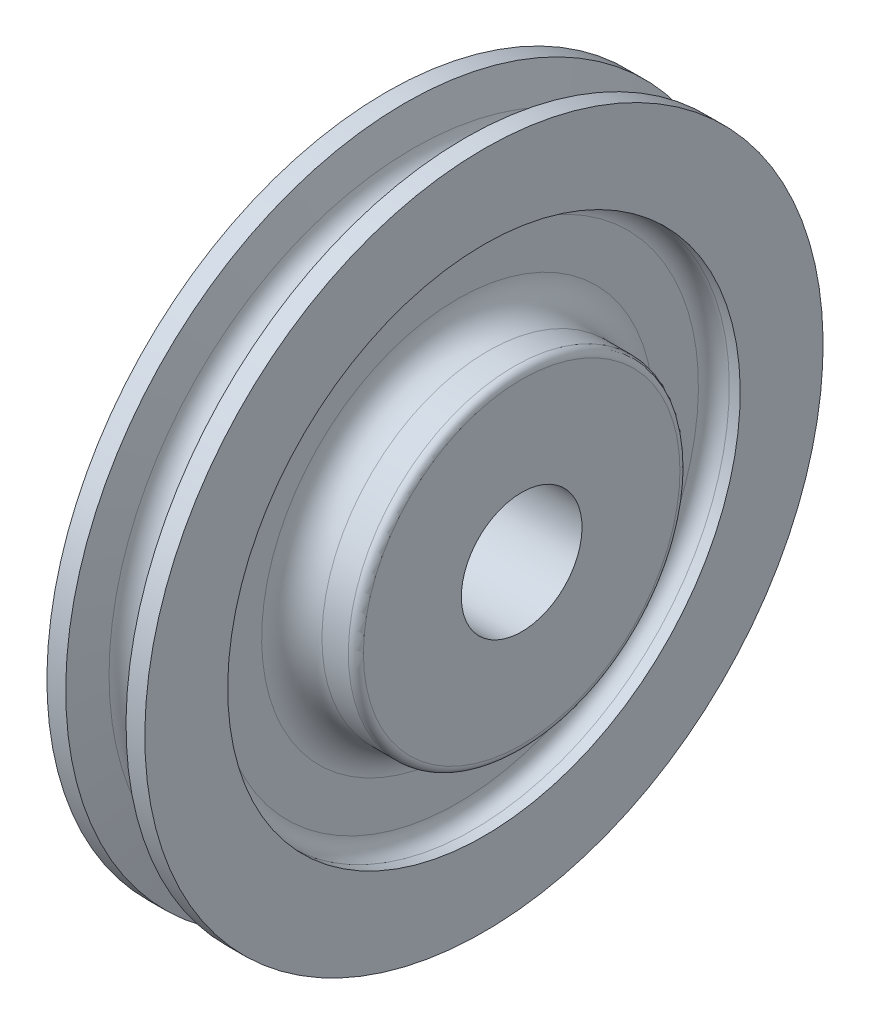
ISO-10303-21;
HEADER;
FILE_DESCRIPTION(('STEP AP214'),'2;1');
FILE_NAME('part.step','',(''),(''),'','','');
FILE_SCHEMA(('AUTOMOTIVE_DESIGN { 1 0 10303 214 1 1 1 1 }'));
ENDSEC;
DATA;
#1=APPLICATION_CONTEXT('core data for automotive mechanical design processes');
#2=APPLICATION_PROTOCOL_DEFINITION('international standard','automotive_design',2000,#1);
#3=PRODUCT_CONTEXT('',#1,'mechanical');
#4=PRODUCT('Part','Part','',(#3));
#5=PRODUCT_RELATED_PRODUCT_CATEGORY('part','',(#4));
#6=PRODUCT_DEFINITION_FORMATION('','',#4);
#7=PRODUCT_DEFINITION_CONTEXT('part definition',#1,'design');
#8=PRODUCT_DEFINITION('design','',#6,#7);
#9=PRODUCT_DEFINITION_SHAPE('','',#8);
#10=(LENGTH_UNIT() NAMED_UNIT(*) SI_UNIT(.MILLI.,.METRE.));
#11=(NAMED_UNIT(*) PLANE_ANGLE_UNIT() SI_UNIT($,.RADIAN.));
#12=(NAMED_UNIT(*) SI_UNIT($,.STERADIAN.) SOLID_ANGLE_UNIT());
#13=UNCERTAINTY_MEASURE_WITH_UNIT(LENGTH_MEASURE(1.E-05),#10,'distance_accuracy_value','');
#14=(GEOMETRIC_REPRESENTATION_CONTEXT(3) GLOBAL_UNCERTAINTY_ASSIGNED_CONTEXT((#13)) GLOBAL_UNIT_ASSIGNED_CONTEXT((#10,
#11,#12)) REPRESENTATION_CONTEXT('',''));
#15=CARTESIAN_POINT('',(0.,0.,0.));
#16=DIRECTION('',(0.,0.,1.));
#17=DIRECTION('',(1.,0.,0.));
#18=AXIS2_PLACEMENT_3D('',#15,#16,#17);
#19=CARTESIAN_POINT('',(11.1124999999993,0.,0.));
#20=DIRECTION('',(1.,0.,0.));
#21=DIRECTION('',(0.,1.,0.));
#22=AXIS2_PLACEMENT_3D('',#19,#20,#21);
#23=TOROIDAL_SURFACE('',#22,41.2750000000005,6.34999999999973);
#24=CARTESIAN_POINT('',(4.7624999999998,0.,0.));
#25=DIRECTION('',(1.,0.,0.));
#26=DIRECTION('',(0.,1.,0.));
#27=AXIS2_PLACEMENT_3D('',#24,#25,#26);
#28=CIRCLE('',#27,41.2749999999999);
#29=CARTESIAN_POINT('',(4.7625,41.2749999999999,0.));
#30=VERTEX_POINT('',#29);
#31=EDGE_CURVE('E10',#30,#30,#28,.T.);
#32=ORIENTED_EDGE('',*,*,#31,.T.);
#33=EDGE_LOOP('',(#32));
#34=FACE_BOUND('',#33,.T.);
#35=CARTESIAN_POINT('',(11.1124999999995,0.,0.));
#36=DIRECTION('',(1.,0.,0.));
#37=DIRECTION('',(0.,1.,0.));
#38=AXIS2_PLACEMENT_3D('',#35,#36,#37);
#39=CIRCLE('',#38,34.9250000000005);
#40=CARTESIAN_POINT('',(11.1124999999996,34.9250000000005,0.));
#41=VERTEX_POINT('',#40);
#42=EDGE_CURVE('E417',#41,#41,#39,.T.);
#43=ORIENTED_EDGE('',*,*,#42,.F.);
#44=EDGE_LOOP('',(#43));
#45=FACE_BOUND('',#44,.T.);
#46=ADVANCED_FACE('F353',(#34,#45),#23,.F.);
#47=CARTESIAN_POINT('',(4.76250000000002,50.7237999999999,0.));
#48=DIRECTION('',(1.,0.,0.));
#49=DIRECTION('',(0.,1.,0.));
#50=AXIS2_PLACEMENT_3D('',#47,#48,#49);
#51=PLANE('',#50);
#52=CARTESIAN_POINT('',(4.76249999999975,0.,0.));
#53=DIRECTION('',(1.,0.,0.));
#54=DIRECTION('',(0.,1.,0.));
#55=AXIS2_PLACEMENT_3D('',#52,#53,#54);
#56=CIRCLE('',#55,50.7237999999999);
#57=CARTESIAN_POINT('',(4.7625,50.7237999999999,0.));
#58=VERTEX_POINT('',#57);
#59=EDGE_CURVE('E359',#58,#58,#56,.T.);
#60=ORIENTED_EDGE('',*,*,#59,.T.);
#61=EDGE_LOOP('',(#60));
#62=FACE_BOUND('',#61,.T.);
#63=ORIENTED_EDGE('',*,*,#31,.F.);
#64=EDGE_LOOP('',(#63));
#65=FACE_BOUND('',#64,.T.);
#66=ADVANCED_FACE('F448',(#62,#65),#51,.T.);
#67=CARTESIAN_POINT('',(8.01369999999975,0.,0.));
#68=DIRECTION('',(1.,0.,0.));
#69=DIRECTION('',(0.,1.,0.));
#70=AXIS2_PLACEMENT_3D('',#67,#68,#69);
#71=TOROIDAL_SURFACE('',#70,50.7238,3.25120000000001);
#72=CARTESIAN_POINT('',(8.01369999999974,0.,0.));
#73=DIRECTION('',(1.,0.,0.));
#74=DIRECTION('',(0.,1.,0.));
#75=AXIS2_PLACEMENT_3D('',#72,#73,#74);
#76=CIRCLE('',#75,53.975);
#77=CARTESIAN_POINT('',(8.0137,53.9749999999999,0.));
#78=VERTEX_POINT('',#77);
#79=EDGE_CURVE('E363',#78,#78,#76,.T.);
#80=ORIENTED_EDGE('',*,*,#79,.T.);
#81=EDGE_LOOP('',(#80));
#82=FACE_BOUND('',#81,.T.);
#83=ORIENTED_EDGE('',*,*,#59,.F.);
#84=EDGE_LOOP('',(#83));
#85=FACE_BOUND('',#84,.T.);
#86=ADVANCED_FACE('F452',(#82,#85),#71,.F.);
#87=CARTESIAN_POINT('',(18.25625,0.,0.));
#88=DIRECTION('',(1.,0.,0.));
#89=DIRECTION('',(0.,1.,0.));
#90=AXIS2_PLACEMENT_3D('',#87,#88,#89);
#91=CYLINDRICAL_SURFACE('',#90,53.9750000000002);
#92=CARTESIAN_POINT('',(10.3123999999997,0.,0.));
#93=DIRECTION('',(1.,0.,0.));
#94=DIRECTION('',(0.,1.,0.));
#95=AXIS2_PLACEMENT_3D('',#92,#93,#94);
#96=CIRCLE('',#95,53.9750000000004);
#97=CARTESIAN_POINT('',(10.3124,53.9750000000003,0.));
#98=VERTEX_POINT('',#97);
#99=EDGE_CURVE('E367',#98,#98,#96,.T.);
#100=ORIENTED_EDGE('',*,*,#99,.T.);
#101=EDGE_LOOP('',(#100));
#102=FACE_BOUND('',#101,.T.);
#103=ORIENTED_EDGE('',*,*,#79,.F.);
#104=EDGE_LOOP('',(#103));
#105=FACE_BOUND('',#104,.T.);
#106=ADVANCED_FACE('F460',(#102,#105),#91,.F.);
#107=CARTESIAN_POINT('',(10.3124,71.4311499999999,0.));
#108=DIRECTION('',(1.,0.,0.));
#109=DIRECTION('',(0.,1.,0.));
#110=AXIS2_PLACEMENT_3D('',#107,#108,#109);
#111=PLANE('',#110);
#112=CARTESIAN_POINT('',(10.3123999999996,0.,0.));
#113=DIRECTION('',(1.,0.,0.));
#114=DIRECTION('',(0.,1.,0.));
#115=AXIS2_PLACEMENT_3D('',#112,#113,#114);
#116=CIRCLE('',#115,71.4311499999999);
#117=CARTESIAN_POINT('',(10.3124,71.4311499999999,0.));
#118=VERTEX_POINT('',#117);
#119=EDGE_CURVE('E372',#118,#118,#116,.T.);
#120=ORIENTED_EDGE('',*,*,#119,.T.);
#121=EDGE_LOOP('',(#120));
#122=FACE_BOUND('',#121,.T.);
#123=ORIENTED_EDGE('',*,*,#99,.F.);
#124=EDGE_LOOP('',(#123));
#125=FACE_BOUND('',#124,.T.);
#126=ADVANCED_FACE('F467',(#122,#125),#111,.T.);
#127=CARTESIAN_POINT('',(18.25625,0.,0.));
#128=DIRECTION('',(1.,0.,0.));
#129=DIRECTION('',(0.,1.,0.));
#130=AXIS2_PLACEMENT_3D('',#127,#128,#129);
#131=CYLINDRICAL_SURFACE('',#130,71.4311499999999);
#132=CARTESIAN_POINT('',(6.34999999999965,0.,0.));
#133=DIRECTION('',(1.,0.,0.));
#134=DIRECTION('',(0.,1.,0.));
#135=AXIS2_PLACEMENT_3D('',#132,#133,#134);
#136=CIRCLE('',#135,71.4311499999999);
#137=CARTESIAN_POINT('',(6.35,71.4311499999999,0.));
#138=VERTEX_POINT('',#137);
#139=EDGE_CURVE('E375',#138,#138,#136,.T.);
#140=ORIENTED_EDGE('',*,*,#139,.T.);
#141=EDGE_LOOP('',(#140));
#142=FACE_BOUND('',#141,.T.);
#143=ORIENTED_EDGE('',*,*,#119,.F.);
#144=EDGE_LOOP('',(#143));
#145=FACE_BOUND('',#144,.T.);
#146=ADVANCED_FACE('F471',(#142,#145),#131,.T.);
#147=CARTESIAN_POINT('',(6.34999999999965,0.,0.));
#148=DIRECTION('',(1.,0.,0.));
#149=DIRECTION('',(0.,1.,0.));
#150=AXIS2_PLACEMENT_3D('',#147,#148,#149);
#151=CONICAL_SURFACE('',#150,71.4311499999999,1.34420065973755);
#152=CARTESIAN_POINT('',(4.64075555889562,0.,0.));
#153=DIRECTION('',(1.,0.,0.));
#154=DIRECTION('',(0.,1.,0.));
#155=AXIS2_PLACEMENT_3D('',#152,#153,#154);
#156=CIRCLE('',#155,64.0175494905948);
#157=CARTESIAN_POINT('',(4.64075555889594,64.0175494905947,0.));
#158=VERTEX_POINT('',#157);
#159=EDGE_CURVE('E378',#158,#158,#156,.T.);
#160=ORIENTED_EDGE('',*,*,#159,.T.);
#161=EDGE_LOOP('',(#160));
#162=FACE_BOUND('',#161,.T.);
#163=ORIENTED_EDGE('',*,*,#139,.F.);
#164=EDGE_LOOP('',(#163));
#165=FACE_BOUND('',#164,.T.);
#166=ADVANCED_FACE('F475',(#162,#165),#151,.T.);
#167=CARTESIAN_POINT('',(-3.22658566531686E-13,0.,0.));
#168=DIRECTION('',(1.,0.,0.));
#169=DIRECTION('',(0.,1.,0.));
#170=AXIS2_PLACEMENT_3D('',#167,#168,#169);
#171=TOROIDAL_SURFACE('',#170,65.0874999999999,4.7625);
#172=CARTESIAN_POINT('',(-4.64075555889625,0.,0.));
#173=DIRECTION('',(1.,0.,0.));
#174=DIRECTION('',(0.,1.,0.));
#175=AXIS2_PLACEMENT_3D('',#172,#173,#174);
#176=CIRCLE('',#175,64.0175494905947);
#177=CARTESIAN_POINT('',(-4.64075555889593,64.0175494905947,0.));
#178=VERTEX_POINT('',#177);
#179=EDGE_CURVE('E381',#178,#178,#176,.T.);
#180=ORIENTED_EDGE('',*,*,#179,.T.);
#181=EDGE_LOOP('',(#180));
#182=FACE_BOUND('',#181,.T.);
#183=ORIENTED_EDGE('',*,*,#159,.F.);
#184=EDGE_LOOP('',(#183));
#185=FACE_BOUND('',#184,.T.);
#186=ADVANCED_FACE('F479',(#182,#185),#171,.F.);
#187=CARTESIAN_POINT('',(-4.64075555889625,0.,0.));
#188=DIRECTION('',(-1.,0.,0.));
#189=DIRECTION('',(0.,-1.,0.));
#190=AXIS2_PLACEMENT_3D('',#187,#188,#189);
#191=CONICAL_SURFACE('',#190,64.0175494905947,1.34420065973754);
#192=CARTESIAN_POINT('',(-6.35000000000035,0.,0.));
#193=DIRECTION('',(1.,0.,0.));
#194=DIRECTION('',(0.,1.,0.));
#195=AXIS2_PLACEMENT_3D('',#192,#193,#194);
#196=CIRCLE('',#195,71.4311499999999);
#197=CARTESIAN_POINT('',(-6.35,71.4311499999999,0.));
#198=VERTEX_POINT('',#197);
#199=EDGE_CURVE('E384',#198,#198,#196,.T.);
#200=ORIENTED_EDGE('',*,*,#199,.T.);
#201=EDGE_LOOP('',(#200));
#202=FACE_BOUND('',#201,.T.);
#203=ORIENTED_EDGE('',*,*,#179,.F.);
#204=EDGE_LOOP('',(#203));
#205=FACE_BOUND('',#204,.T.);
#206=ADVANCED_FACE('F483',(#202,#205),#191,.T.);
#207=CARTESIAN_POINT('',(18.25625,0.,0.));
#208=DIRECTION('',(1.,0.,0.));
#209=DIRECTION('',(0.,1.,0.));
#210=AXIS2_PLACEMENT_3D('',#207,#208,#209);
#211=CYLINDRICAL_SURFACE('',#210,71.4311499999998);
#212=CARTESIAN_POINT('',(-10.3124000000003,0.,0.));
#213=DIRECTION('',(1.,0.,0.));
#214=DIRECTION('',(0.,1.,0.));
#215=AXIS2_PLACEMENT_3D('',#212,#213,#214);
#216=CIRCLE('',#215,71.4311499999998);
#217=CARTESIAN_POINT('',(-10.3124,71.4311499999999,0.));
#218=VERTEX_POINT('',#217);
#219=EDGE_CURVE('E387',#218,#218,#216,.T.);
#220=ORIENTED_EDGE('',*,*,#219,.T.);
#221=EDGE_LOOP('',(#220));
#222=FACE_BOUND('',#221,.T.);
#223=ORIENTED_EDGE('',*,*,#199,.F.);
#224=EDGE_LOOP('',(#223));
#225=FACE_BOUND('',#224,.T.);
#226=ADVANCED_FACE('F487',(#222,#225),#211,.T.);
#227=CARTESIAN_POINT('',(-10.3123999999999,71.4311499999999,0.));
#228=DIRECTION('',(-1.,0.,0.));
#229=DIRECTION('',(0.,-1.,0.));
#230=AXIS2_PLACEMENT_3D('',#227,#228,#229);
#231=PLANE('',#230);
#232=CARTESIAN_POINT('',(-10.3124000000003,0.,0.));
#233=DIRECTION('',(1.,0.,0.));
#234=DIRECTION('',(0.,1.,0.));
#235=AXIS2_PLACEMENT_3D('',#232,#233,#234);
#236=CIRCLE('',#235,53.9750000000003);
#237=CARTESIAN_POINT('',(-10.3124,53.9750000000003,0.));
#238=VERTEX_POINT('',#237);
#239=EDGE_CURVE('E390',#238,#238,#236,.T.);
#240=ORIENTED_EDGE('',*,*,#239,.T.);
#241=EDGE_LOOP('',(#240));
#242=FACE_BOUND('',#241,.T.);
#243=ORIENTED_EDGE('',*,*,#219,.F.);
#244=EDGE_LOOP('',(#243));
#245=FACE_BOUND('',#244,.T.);
#246=ADVANCED_FACE('F491',(#242,#245),#231,.T.);
#247=CARTESIAN_POINT('',(18.25625,0.,0.));
#248=DIRECTION('',(1.,0.,0.));
#249=DIRECTION('',(0.,1.,0.));
#250=AXIS2_PLACEMENT_3D('',#247,#248,#249);
#251=CYLINDRICAL_SURFACE('',#250,53.9750000000001);
#252=CARTESIAN_POINT('',(-8.01370000000027,0.,0.));
#253=DIRECTION('',(1.,0.,0.));
#254=DIRECTION('',(0.,1.,0.));
#255=AXIS2_PLACEMENT_3D('',#252,#253,#254);
#256=CIRCLE('',#255,53.9749999999999);
#257=CARTESIAN_POINT('',(-8.01370000000001,53.9749999999999,0.));
#258=VERTEX_POINT('',#257);
#259=EDGE_CURVE('E393',#258,#258,#256,.T.);
#260=ORIENTED_EDGE('',*,*,#259,.T.);
#261=EDGE_LOOP('',(#260));
#262=FACE_BOUND('',#261,.T.);
#263=ORIENTED_EDGE('',*,*,#239,.F.);
#264=EDGE_LOOP('',(#263));
#265=FACE_BOUND('',#264,.T.);
#266=ADVANCED_FACE('F495',(#262,#265),#251,.F.);
#267=CARTESIAN_POINT('',(-8.01370000000026,0.,0.));
#268=DIRECTION('',(1.,0.,0.));
#269=DIRECTION('',(0.,1.,0.));
#270=AXIS2_PLACEMENT_3D('',#267,#268,#269);
#271=TOROIDAL_SURFACE('',#270,50.7237999999999,3.25120000000001);
#272=CARTESIAN_POINT('',(-4.76250000000025,0.,0.));
#273=DIRECTION('',(1.,0.,0.));
#274=DIRECTION('',(0.,1.,0.));
#275=AXIS2_PLACEMENT_3D('',#272,#273,#274);
#276=CIRCLE('',#275,50.7237999999999);
#277=CARTESIAN_POINT('',(-4.76249999999999,50.7237999999999,0.));
#278=VERTEX_POINT('',#277);
#279=EDGE_CURVE('E396',#278,#278,#276,.T.);
#280=ORIENTED_EDGE('',*,*,#279,.T.);
#281=EDGE_LOOP('',(#280));
#282=FACE_BOUND('',#281,.T.);
#283=ORIENTED_EDGE('',*,*,#259,.F.);
#284=EDGE_LOOP('',(#283));
#285=FACE_BOUND('',#284,.T.);
#286=ADVANCED_FACE('F499',(#282,#285),#271,.F.);
#287=CARTESIAN_POINT('',(-4.76249999999998,50.7237999999999,0.));
#288=DIRECTION('',(-1.,0.,0.));
#289=DIRECTION('',(0.,-1.,0.));
#290=AXIS2_PLACEMENT_3D('',#287,#288,#289);
#291=PLANE('',#290);
#292=CARTESIAN_POINT('',(-4.76250000000021,0.,0.));
#293=DIRECTION('',(1.,0.,0.));
#294=DIRECTION('',(0.,1.,0.));
#295=AXIS2_PLACEMENT_3D('',#292,#293,#294);
#296=CIRCLE('',#295,41.2749999999999);
#297=CARTESIAN_POINT('',(-4.7625,41.2749999999999,0.));
#298=VERTEX_POINT('',#297);
#299=EDGE_CURVE('E399',#298,#298,#296,.T.);
#300=ORIENTED_EDGE('',*,*,#299,.T.);
#301=EDGE_LOOP('',(#300));
#302=FACE_BOUND('',#301,.T.);
#303=ORIENTED_EDGE('',*,*,#279,.F.);
#304=EDGE_LOOP('',(#303));
#305=FACE_BOUND('',#304,.T.);
#306=ADVANCED_FACE('F503',(#302,#305),#291,.T.);
#307=CARTESIAN_POINT('',(-11.1125000000008,0.,0.));
#308=DIRECTION('',(1.,0.,0.));
#309=DIRECTION('',(0.,1.,0.));
#310=AXIS2_PLACEMENT_3D('',#307,#308,#309);
#311=TOROIDAL_SURFACE('',#310,41.275,6.35000000000027);
#312=CARTESIAN_POINT('',(-11.1125000000005,0.,0.));
#313=DIRECTION('',(1.,0.,0.));
#314=DIRECTION('',(0.,1.,0.));
#315=AXIS2_PLACEMENT_3D('',#312,#313,#314);
#316=CIRCLE('',#315,34.9249999999998);
#317=CARTESIAN_POINT('',(-11.1125000000004,34.9249999999998,0.));
#318=VERTEX_POINT('',#317);
#319=EDGE_CURVE('E402',#318,#318,#316,.T.);
#320=ORIENTED_EDGE('',*,*,#319,.T.);
#321=EDGE_LOOP('',(#320));
#322=FACE_BOUND('',#321,.T.);
#323=ORIENTED_EDGE('',*,*,#299,.F.);
#324=EDGE_LOOP('',(#323));
#325=FACE_BOUND('',#324,.T.);
#326=ADVANCED_FACE('F507',(#322,#325),#311,.F.);
#327=CARTESIAN_POINT('',(18.25625,0.,0.));
#328=DIRECTION('',(1.,0.,0.));
#329=DIRECTION('',(0.,1.,0.));
#330=AXIS2_PLACEMENT_3D('',#327,#328,#329);
#331=CYLINDRICAL_SURFACE('',#330,34.9249999999999);
#332=CARTESIAN_POINT('',(-16.6687500000002,0.,0.));
#333=DIRECTION('',(1.,0.,0.));
#334=DIRECTION('',(0.,1.,0.));
#335=AXIS2_PLACEMENT_3D('',#332,#333,#334);
#336=CIRCLE('',#335,34.925);
#337=CARTESIAN_POINT('',(-16.66875,34.9250000000001,0.));
#338=VERTEX_POINT('',#337);
#339=EDGE_CURVE('E405',#338,#338,#336,.T.);
#340=ORIENTED_EDGE('',*,*,#339,.T.);
#341=EDGE_LOOP('',(#340));
#342=FACE_BOUND('',#341,.T.);
#343=ORIENTED_EDGE('',*,*,#319,.F.);
#344=EDGE_LOOP('',(#343));
#345=FACE_BOUND('',#344,.T.);
#346=ADVANCED_FACE('F511',(#342,#345),#331,.T.);
#347=CARTESIAN_POINT('',(-16.6687500000002,0.,0.));
#348=DIRECTION('',(1.,0.,0.));
#349=DIRECTION('',(0.,1.,0.));
#350=AXIS2_PLACEMENT_3D('',#347,#348,#349);
#351=TOROIDAL_SURFACE('',#350,33.3375,1.5875);
#352=CARTESIAN_POINT('',(-18.2562500000002,0.,0.));
#353=DIRECTION('',(1.,0.,0.));
#354=DIRECTION('',(0.,1.,0.));
#355=AXIS2_PLACEMENT_3D('',#352,#353,#354);
#356=CIRCLE('',#355,33.3375);
#357=CARTESIAN_POINT('',(-18.25625,33.3375000000001,0.));
#358=VERTEX_POINT('',#357);
#359=EDGE_CURVE('E408',#358,#358,#356,.T.);
#360=ORIENTED_EDGE('',*,*,#359,.T.);
#361=EDGE_LOOP('',(#360));
#362=FACE_BOUND('',#361,.T.);
#363=ORIENTED_EDGE('',*,*,#339,.F.);
#364=EDGE_LOOP('',(#363));
#365=FACE_BOUND('',#364,.T.);
#366=ADVANCED_FACE('F515',(#362,#365),#351,.T.);
#367=CARTESIAN_POINT('',(-18.2562499999999,33.3375000000001,0.));
#368=DIRECTION('',(-1.,0.,0.));
#369=DIRECTION('',(0.,-1.,0.));
#370=AXIS2_PLACEMENT_3D('',#367,#368,#369);
#371=PLANE('',#370);
#372=CARTESIAN_POINT('',(-18.2562500000004,0.,0.));
#373=DIRECTION('',(1.,0.,0.));
#374=DIRECTION('',(0.,1.,0.));
#375=AXIS2_PLACEMENT_3D('',#372,#373,#374);
#376=CIRCLE('',#375,12.7127);
#377=CARTESIAN_POINT('',(-18.2562500000003,12.7127000000001,0.));
#378=VERTEX_POINT('',#377);
#379=EDGE_CURVE('E420',#378,#378,#376,.T.);
#380=ORIENTED_EDGE('',*,*,#379,.T.);
#381=EDGE_LOOP('',(#380));
#382=FACE_BOUND('',#381,.T.);
#383=ORIENTED_EDGE('',*,*,#359,.F.);
#384=EDGE_LOOP('',(#383));
#385=FACE_BOUND('',#384,.T.);
#386=ADVANCED_FACE('F433',(#382,#385),#371,.T.);
#387=CARTESIAN_POINT('',(18.25625,33.3375000000005,0.));
#388=DIRECTION('',(1.,0.,0.));
#389=DIRECTION('',(0.,1.,0.));
#390=AXIS2_PLACEMENT_3D('',#387,#388,#389);
#391=PLANE('',#390);
#392=CARTESIAN_POINT('',(18.2562499999998,0.,0.));
#393=DIRECTION('',(1.,0.,0.));
#394=DIRECTION('',(0.,1.,0.));
#395=AXIS2_PLACEMENT_3D('',#392,#393,#394);
#396=CIRCLE('',#395,12.7127);
#397=CARTESIAN_POINT('',(18.2562499999999,12.7126999999999,0.));
#398=VERTEX_POINT('',#397);
#399=EDGE_CURVE('E423',#398,#398,#396,.T.);
#400=ORIENTED_EDGE('',*,*,#399,.F.);
#401=EDGE_LOOP('',(#400));
#402=FACE_BOUND('',#401,.T.);
#403=CARTESIAN_POINT('',(18.2562499999997,0.,0.));
#404=DIRECTION('',(1.,0.,0.));
#405=DIRECTION('',(0.,1.,0.));
#406=AXIS2_PLACEMENT_3D('',#403,#404,#405);
#407=CIRCLE('',#406,33.3375000000006);
#408=CARTESIAN_POINT('',(18.2562499999998,33.3375000000005,0.));
#409=VERTEX_POINT('',#408);
#410=EDGE_CURVE('E411',#409,#409,#407,.T.);
#411=ORIENTED_EDGE('',*,*,#410,.T.);
#412=EDGE_LOOP('',(#411));
#413=FACE_BOUND('',#412,.T.);
#414=ADVANCED_FACE('F429',(#402,#413),#391,.T.);
#415=CARTESIAN_POINT('',(16.6687499999997,0.,0.));
#416=DIRECTION('',(1.,0.,0.));
#417=DIRECTION('',(0.,1.,0.));
#418=AXIS2_PLACEMENT_3D('',#415,#416,#417);
#419=TOROIDAL_SURFACE('',#418,33.3375000000005,1.5875);
#420=CARTESIAN_POINT('',(16.6687499999996,0.,0.));
#421=DIRECTION('',(1.,0.,0.));
#422=DIRECTION('',(0.,1.,0.));
#423=AXIS2_PLACEMENT_3D('',#420,#421,#422);
#424=CIRCLE('',#423,34.9250000000005);
#425=CARTESIAN_POINT('',(16.6687499999998,34.9250000000005,0.));
#426=VERTEX_POINT('',#425);
#427=EDGE_CURVE('E414',#426,#426,#424,.T.);
#428=ORIENTED_EDGE('',*,*,#427,.T.);
#429=EDGE_LOOP('',(#428));
#430=FACE_BOUND('',#429,.T.);
#431=ORIENTED_EDGE('',*,*,#410,.F.);
#432=EDGE_LOOP('',(#431));
#433=FACE_BOUND('',#432,.T.);
#434=ADVANCED_FACE('F432',(#430,#433),#419,.T.);
#435=CARTESIAN_POINT('',(18.25625,0.,0.));
#436=DIRECTION('',(1.,0.,0.));
#437=DIRECTION('',(0.,1.,0.));
#438=AXIS2_PLACEMENT_3D('',#435,#436,#437);
#439=CYLINDRICAL_SURFACE('',#438,34.9250000000005);
#440=ORIENTED_EDGE('',*,*,#42,.T.);
#441=EDGE_LOOP('',(#440));
#442=FACE_BOUND('',#441,.T.);
#443=ORIENTED_EDGE('',*,*,#427,.F.);
#444=EDGE_LOOP('',(#443));
#445=FACE_BOUND('',#444,.T.);
#446=ADVANCED_FACE('F438',(#442,#445),#439,.T.);
#447=CARTESIAN_POINT('',(-18.2562500000004,0.,0.));
#448=DIRECTION('',(1.,0.,0.));
#449=DIRECTION('',(0.,1.,0.));
#450=AXIS2_PLACEMENT_3D('',#447,#448,#449);
#451=CYLINDRICAL_SURFACE('',#450,12.7127);
#452=ORIENTED_EDGE('',*,*,#379,.F.);
#453=EDGE_LOOP('',(#452));
#454=FACE_BOUND('',#453,.T.);
#455=ORIENTED_EDGE('',*,*,#399,.T.);
#456=EDGE_LOOP('',(#455));
#457=FACE_BOUND('',#456,.T.);
#458=ADVANCED_FACE('F427',(#454,#457),#451,.F.);
#459=CLOSED_SHELL('',(#46,#66,#86,#106,#126,#146,#166,#186,#206,#226,#246,#266,#286,#306,#326,
#346,#366,#386,#414,#434,#446,#458));
#460=MANIFOLD_SOLID_BREP('B2',#459);
#461=ADVANCED_BREP_SHAPE_REPRESENTATION('',(#18,#460),#14);
#462=SHAPE_DEFINITION_REPRESENTATION(#9,#461);
ENDSEC;
END-ISO-10303-21;
